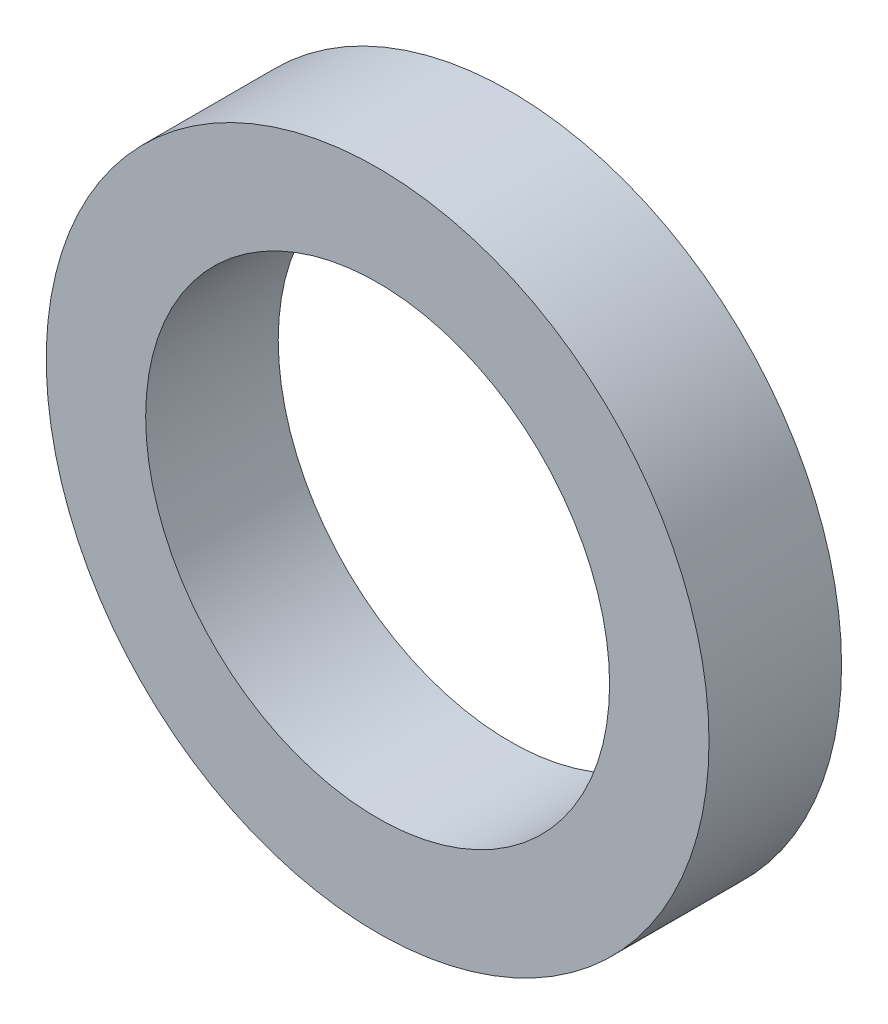
ISO-10303-21;
HEADER;
FILE_DESCRIPTION(('STEP AP214'),'2;1');
FILE_NAME('part.step','',(''),(''),'','','');
FILE_SCHEMA(('AUTOMOTIVE_DESIGN { 1 0 10303 214 1 1 1 1 }'));
ENDSEC;
DATA;
#1=APPLICATION_CONTEXT('core data for automotive mechanical design processes');
#2=APPLICATION_PROTOCOL_DEFINITION('international standard','automotive_design',2000,#1);
#3=PRODUCT_CONTEXT('',#1,'mechanical');
#4=PRODUCT('Part','Part','',(#3));
#5=PRODUCT_RELATED_PRODUCT_CATEGORY('part','',(#4));
#6=PRODUCT_DEFINITION_FORMATION('','',#4);
#7=PRODUCT_DEFINITION_CONTEXT('part definition',#1,'design');
#8=PRODUCT_DEFINITION('design','',#6,#7);
#9=PRODUCT_DEFINITION_SHAPE('','',#8);
#10=(LENGTH_UNIT() NAMED_UNIT(*) SI_UNIT(.MILLI.,.METRE.));
#11=(NAMED_UNIT(*) PLANE_ANGLE_UNIT() SI_UNIT($,.RADIAN.));
#12=(NAMED_UNIT(*) SI_UNIT($,.STERADIAN.) SOLID_ANGLE_UNIT());
#13=UNCERTAINTY_MEASURE_WITH_UNIT(LENGTH_MEASURE(1.E-05),#10,'distance_accuracy_value','');
#14=(GEOMETRIC_REPRESENTATION_CONTEXT(3) GLOBAL_UNCERTAINTY_ASSIGNED_CONTEXT((#13)) GLOBAL_UNIT_ASSIGNED_CONTEXT((#10,
#11,#12)) REPRESENTATION_CONTEXT('',''));
#15=CARTESIAN_POINT('',(0.,0.,0.));
#16=DIRECTION('',(0.,0.,1.));
#17=DIRECTION('',(1.,0.,0.));
#18=AXIS2_PLACEMENT_3D('',#15,#16,#17);
#19=CARTESIAN_POINT('',(0.,0.,4.));
#20=DIRECTION('',(0.,0.,1.));
#21=DIRECTION('',(1.,0.,0.));
#22=AXIS2_PLACEMENT_3D('',#19,#20,#21);
#23=PLANE('',#22);
#24=CARTESIAN_POINT('',(0.,0.,4.));
#25=DIRECTION('',(0.,0.,1.));
#26=DIRECTION('',(1.,0.,0.));
#27=AXIS2_PLACEMENT_3D('',#24,#25,#26);
#28=CIRCLE('',#27,10.);
#29=CARTESIAN_POINT('',(10.,0.,4.));
#30=VERTEX_POINT('',#29);
#31=EDGE_CURVE('E10',#30,#30,#28,.T.);
#32=ORIENTED_EDGE('',*,*,#31,.T.);
#33=EDGE_LOOP('',(#32));
#34=FACE_BOUND('',#33,.T.);
#35=CARTESIAN_POINT('',(0.,0.,4.));
#36=DIRECTION('',(0.,0.,1.));
#37=DIRECTION('',(1.,0.,0.));
#38=AXIS2_PLACEMENT_3D('',#35,#36,#37);
#39=CIRCLE('',#38,7.);
#40=CARTESIAN_POINT('',(7.,0.,4.));
#41=VERTEX_POINT('',#40);
#42=EDGE_CURVE('E50',#41,#41,#39,.T.);
#43=ORIENTED_EDGE('',*,*,#42,.F.);
#44=EDGE_LOOP('',(#43));
#45=FACE_BOUND('',#44,.T.);
#46=ADVANCED_FACE('F37',(#34,#45),#23,.T.);
#47=CARTESIAN_POINT('',(0.,0.,0.));
#48=DIRECTION('',(0.,0.,1.));
#49=DIRECTION('',(1.,0.,0.));
#50=AXIS2_PLACEMENT_3D('',#47,#48,#49);
#51=PLANE('',#50);
#52=CARTESIAN_POINT('',(0.,0.,0.));
#53=DIRECTION('',(0.,0.,1.));
#54=DIRECTION('',(1.,0.,0.));
#55=AXIS2_PLACEMENT_3D('',#52,#53,#54);
#56=CIRCLE('',#55,10.);
#57=CARTESIAN_POINT('',(10.,0.,0.));
#58=VERTEX_POINT('',#57);
#59=EDGE_CURVE('E41',#58,#58,#56,.T.);
#60=ORIENTED_EDGE('',*,*,#59,.F.);
#61=EDGE_LOOP('',(#60));
#62=FACE_BOUND('',#61,.T.);
#63=CARTESIAN_POINT('',(0.,0.,0.));
#64=DIRECTION('',(0.,0.,1.));
#65=DIRECTION('',(1.,0.,0.));
#66=AXIS2_PLACEMENT_3D('',#63,#64,#65);
#67=CIRCLE('',#66,7.);
#68=CARTESIAN_POINT('',(7.,0.,0.));
#69=VERTEX_POINT('',#68);
#70=EDGE_CURVE('E52',#69,#69,#67,.T.);
#71=ORIENTED_EDGE('',*,*,#70,.T.);
#72=EDGE_LOOP('',(#71));
#73=FACE_BOUND('',#72,.T.);
#74=ADVANCED_FACE('F64',(#62,#73),#51,.F.);
#75=CARTESIAN_POINT('',(0.,0.,4.));
#76=DIRECTION('',(0.,0.,-1.));
#77=DIRECTION('',(-1.,0.,0.));
#78=AXIS2_PLACEMENT_3D('',#75,#76,#77);
#79=CYLINDRICAL_SURFACE('',#78,10.);
#80=ORIENTED_EDGE('',*,*,#31,.F.);
#81=EDGE_LOOP('',(#80));
#82=FACE_BOUND('',#81,.T.);
#83=ORIENTED_EDGE('',*,*,#59,.T.);
#84=EDGE_LOOP('',(#83));
#85=FACE_BOUND('',#84,.T.);
#86=ADVANCED_FACE('F39',(#82,#85),#79,.T.);
#87=CARTESIAN_POINT('',(0.,0.,4.));
#88=DIRECTION('',(0.,0.,-1.));
#89=DIRECTION('',(-1.,0.,0.));
#90=AXIS2_PLACEMENT_3D('',#87,#88,#89);
#91=CYLINDRICAL_SURFACE('',#90,7.);
#92=ORIENTED_EDGE('',*,*,#42,.T.);
#93=EDGE_LOOP('',(#92));
#94=FACE_BOUND('',#93,.T.);
#95=ORIENTED_EDGE('',*,*,#70,.F.);
#96=EDGE_LOOP('',(#95));
#97=FACE_BOUND('',#96,.T.);
#98=ADVANCED_FACE('F60',(#94,#97),#91,.F.);
#99=CLOSED_SHELL('',(#46,#74,#86,#98));
#100=MANIFOLD_SOLID_BREP('B2',#99);
#101=ADVANCED_BREP_SHAPE_REPRESENTATION('',(#18,#100),#14);
#102=SHAPE_DEFINITION_REPRESENTATION(#9,#101);
ENDSEC;
END-ISO-10303-21;
